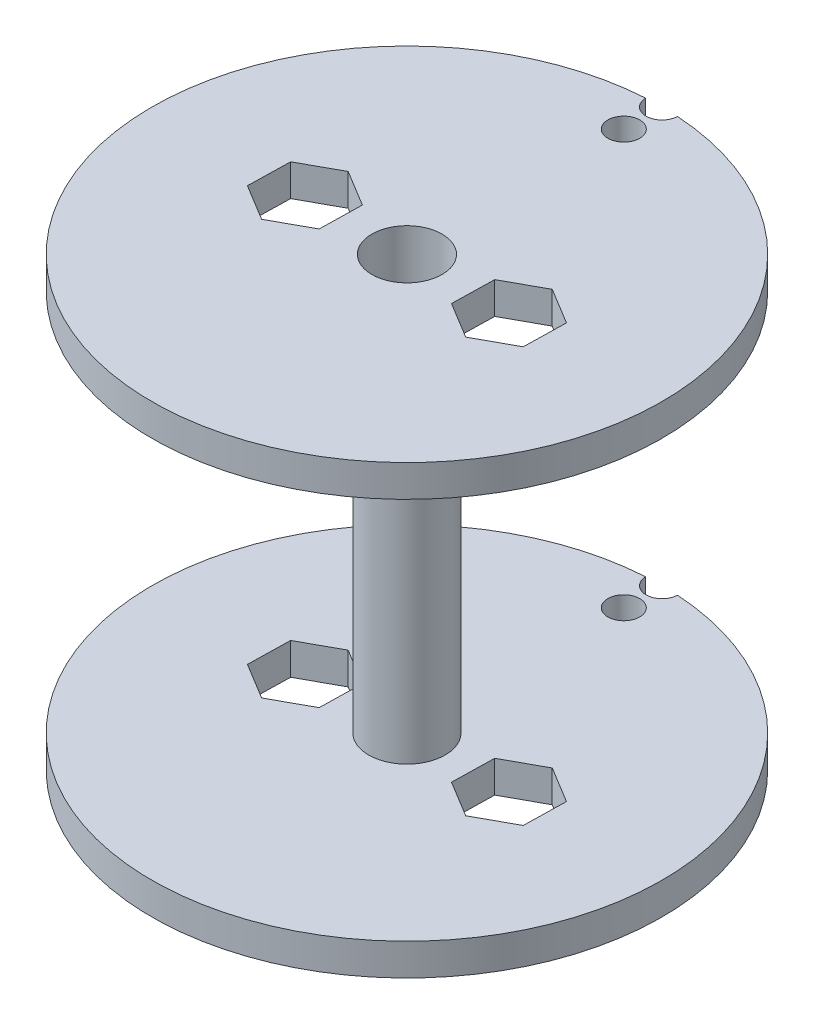
ISO-10303-21;
HEADER;
FILE_DESCRIPTION(('STEP AP214'),'2;1');
FILE_NAME('part.step','',(''),(''),'','','');
FILE_SCHEMA(('AUTOMOTIVE_DESIGN { 1 0 10303 214 1 1 1 1 }'));
ENDSEC;
DATA;
#1=APPLICATION_CONTEXT('core data for automotive mechanical design processes');
#2=APPLICATION_PROTOCOL_DEFINITION('international standard','automotive_design',2000,#1);
#3=PRODUCT_CONTEXT('',#1,'mechanical');
#4=PRODUCT('Part','Part','',(#3));
#5=PRODUCT_RELATED_PRODUCT_CATEGORY('part','',(#4));
#6=PRODUCT_DEFINITION_FORMATION('','',#4);
#7=PRODUCT_DEFINITION_CONTEXT('part definition',#1,'design');
#8=PRODUCT_DEFINITION('design','',#6,#7);
#9=PRODUCT_DEFINITION_SHAPE('','',#8);
#10=(LENGTH_UNIT() NAMED_UNIT(*) SI_UNIT(.MILLI.,.METRE.));
#11=(NAMED_UNIT(*) PLANE_ANGLE_UNIT() SI_UNIT($,.RADIAN.));
#12=(NAMED_UNIT(*) SI_UNIT($,.STERADIAN.) SOLID_ANGLE_UNIT());
#13=UNCERTAINTY_MEASURE_WITH_UNIT(LENGTH_MEASURE(1.E-05),#10,'distance_accuracy_value','');
#14=(GEOMETRIC_REPRESENTATION_CONTEXT(3) GLOBAL_UNCERTAINTY_ASSIGNED_CONTEXT((#13)) GLOBAL_UNIT_ASSIGNED_CONTEXT((#10,
#11,#12)) REPRESENTATION_CONTEXT('',''));
#15=CARTESIAN_POINT('',(0.,0.,0.));
#16=DIRECTION('',(0.,0.,1.));
#17=DIRECTION('',(1.,0.,0.));
#18=AXIS2_PLACEMENT_3D('',#15,#16,#17);
#19=CARTESIAN_POINT('',(0.,2.5,0.));
#20=DIRECTION('',(0.,1.,0.));
#21=DIRECTION('',(0.,0.,1.));
#22=AXIS2_PLACEMENT_3D('',#19,#20,#21);
#23=PLANE('',#22);
#24=DIRECTION('',(-0.0214869779830933,0.,0.999769128237692));
#25=VECTOR('',#24,1.);
#26=CARTESIAN_POINT('',(-5.08999790781407,2.5,-1.59772374233));
#27=LINE('',#26,#25);
#28=CARTESIAN_POINT('',(-5.08999790781407,2.5,-1.59772374233));
#29=VERTEX_POINT('',#28);
#30=CARTESIAN_POINT('',(-5.16132960481908,2.5,1.72127386573417));
#31=VERTEX_POINT('',#30);
#32=EDGE_CURVE('E484',#29,#31,#27,.T.);
#33=ORIENTED_EDGE('',*,*,#32,.T.);
#34=DIRECTION('',(-0.87656895196481,0.,0.48127629533493));
#35=VECTOR('',#34,1.);
#36=CARTESIAN_POINT('',(-5.16132960481908,2.5,1.72127386573417));
#37=LINE('',#36,#35);
#38=CARTESIAN_POINT('',(-8.07133169700495,2.5,3.31899760806487));
#39=VERTEX_POINT('',#38);
#40=EDGE_CURVE('E488',#31,#39,#37,.T.);
#41=ORIENTED_EDGE('',*,*,#40,.T.);
#42=DIRECTION('',(-0.855081973981716,0.,-0.518492832902762));
#43=VECTOR('',#42,1.);
#44=CARTESIAN_POINT('',(-8.07133169700495,2.5,3.31899760806487));
#45=LINE('',#44,#43);
#46=CARTESIAN_POINT('',(-10.9100020921858,2.5,1.59772374233139));
#47=VERTEX_POINT('',#46);
#48=EDGE_CURVE('E493',#39,#47,#45,.T.);
#49=ORIENTED_EDGE('',*,*,#48,.T.);
#50=DIRECTION('',(0.0214869779830943,0.,-0.999769128237692));
#51=VECTOR('',#50,1.);
#52=CARTESIAN_POINT('',(-10.9100020921858,2.5,1.59772374233139));
#53=LINE('',#52,#51);
#54=CARTESIAN_POINT('',(-10.8386703951808,2.5,-1.72127386573279));
#55=VERTEX_POINT('',#54);
#56=EDGE_CURVE('E497',#47,#55,#53,.T.);
#57=ORIENTED_EDGE('',*,*,#56,.T.);
#58=DIRECTION('',(0.87656895196481,0.,-0.48127629533493));
#59=VECTOR('',#58,1.);
#60=CARTESIAN_POINT('',(-10.8386703951808,2.5,-1.72127386573279));
#61=LINE('',#60,#59);
#62=CARTESIAN_POINT('',(-7.92866830299493,2.5,-3.31899760806348));
#63=VERTEX_POINT('',#62);
#64=EDGE_CURVE('E501',#55,#63,#61,.T.);
#65=ORIENTED_EDGE('',*,*,#64,.T.);
#66=DIRECTION('',(0.855081973981716,0.,0.518492832902762));
#67=VECTOR('',#66,1.);
#68=CARTESIAN_POINT('',(-7.92866830299493,2.5,-3.31899760806348));
#69=LINE('',#68,#67);
#70=EDGE_CURVE('E505',#63,#29,#69,.T.);
#71=ORIENTED_EDGE('',*,*,#70,.T.);
#72=EDGE_LOOP('',(#33,#41,#49,#57,#65,#71));
#73=FACE_BOUND('',#72,.T.);
#74=DIRECTION('',(0.0214869779832137,0.,-0.999769128237689));
#75=VECTOR('',#74,1.);
#76=CARTESIAN_POINT('',(5.089997907814,2.5,1.59772374233007));
#77=LINE('',#76,#75);
#78=CARTESIAN_POINT('',(5.089997907814,2.5,1.59772374233007));
#79=VERTEX_POINT('',#78);
#80=CARTESIAN_POINT('',(5.16132960481941,2.5,-1.72127386573409));
#81=VERTEX_POINT('',#80);
#82=EDGE_CURVE('E418',#79,#81,#77,.T.);
#83=ORIENTED_EDGE('',*,*,#82,.T.);
#84=DIRECTION('',(0.876568951964868,0.,-0.481276295334824));
#85=VECTOR('',#84,1.);
#86=CARTESIAN_POINT('',(5.16132960481941,2.5,-1.72127386573409));
#87=LINE('',#86,#85);
#88=CARTESIAN_POINT('',(8.07133169700547,2.5,-3.31899760806444));
#89=VERTEX_POINT('',#88);
#90=EDGE_CURVE('E422',#81,#89,#87,.T.);
#91=ORIENTED_EDGE('',*,*,#90,.T.);
#92=DIRECTION('',(0.855081973981654,0.,0.518492832902865));
#93=VECTOR('',#92,1.);
#94=CARTESIAN_POINT('',(8.07133169700547,2.5,-3.31899760806444));
#95=LINE('',#94,#93);
#96=CARTESIAN_POINT('',(10.9100020921861,2.5,-1.59772374233061));
#97=VERTEX_POINT('',#96);
#98=EDGE_CURVE('E64',#89,#97,#95,.T.);
#99=ORIENTED_EDGE('',*,*,#98,.T.);
#100=DIRECTION('',(-0.021486977983214,0.,0.999769128237689));
#101=VECTOR('',#100,1.);
#102=CARTESIAN_POINT('',(10.9100020921861,2.5,-1.59772374233061));
#103=LINE('',#102,#101);
#104=CARTESIAN_POINT('',(10.8386703951807,2.5,1.72127386573356));
#105=VERTEX_POINT('',#104);
#106=EDGE_CURVE('E429',#97,#105,#103,.T.);
#107=ORIENTED_EDGE('',*,*,#106,.T.);
#108=DIRECTION('',(-0.876568951964868,0.,0.481276295334824));
#109=VECTOR('',#108,1.);
#110=CARTESIAN_POINT('',(10.8386703951807,2.5,1.72127386573356));
#111=LINE('',#110,#109);
#112=CARTESIAN_POINT('',(7.92866830299465,2.5,3.3189976080639));
#113=VERTEX_POINT('',#112);
#114=EDGE_CURVE('E433',#105,#113,#111,.T.);
#115=ORIENTED_EDGE('',*,*,#114,.T.);
#116=DIRECTION('',(-0.855081973981654,0.,-0.518492832902865));
#117=VECTOR('',#116,1.);
#118=CARTESIAN_POINT('',(7.92866830299465,2.5,3.3189976080639));
#119=LINE('',#118,#117);
#120=EDGE_CURVE('E437',#113,#79,#119,.T.);
#121=ORIENTED_EDGE('',*,*,#120,.T.);
#122=EDGE_LOOP('',(#83,#91,#99,#107,#115,#121));
#123=FACE_BOUND('',#122,.T.);
#124=CARTESIAN_POINT('',(0.,2.5,-20.));
#125=DIRECTION('',(0.,1.,0.));
#126=DIRECTION('',(0.,0.,1.));
#127=AXIS2_PLACEMENT_3D('',#124,#125,#126);
#128=CIRCLE('',#127,1.25);
#129=CARTESIAN_POINT('',(-1.24938949935309,2.5,-19.9609375));
#130=VERTEX_POINT('',#129);
#131=CARTESIAN_POINT('',(1.24938949935309,2.5,-19.9609375));
#132=VERTEX_POINT('',#131);
#133=EDGE_CURVE('E409',#130,#132,#128,.T.);
#134=ORIENTED_EDGE('',*,*,#133,.F.);
#135=CARTESIAN_POINT('',(0.,2.5,0.));
#136=DIRECTION('',(0.,1.,0.));
#137=DIRECTION('',(0.,0.,1.));
#138=AXIS2_PLACEMENT_3D('',#135,#136,#137);
#139=CIRCLE('',#138,20.);
#140=EDGE_CURVE('E553',#130,#132,#139,.T.);
#141=ORIENTED_EDGE('',*,*,#140,.T.);
#142=EDGE_LOOP('',(#134,#141));
#143=FACE_BOUND('',#142,.T.);
#144=CARTESIAN_POINT('',(0.,2.5,-17.));
#145=DIRECTION('',(0.,1.,0.));
#146=DIRECTION('',(0.,0.,1.));
#147=AXIS2_PLACEMENT_3D('',#144,#145,#146);
#148=CIRCLE('',#147,1.25);
#149=CARTESIAN_POINT('',(0.,2.5,-15.75));
#150=VERTEX_POINT('',#149);
#151=EDGE_CURVE('E410',#150,#150,#148,.T.);
#152=ORIENTED_EDGE('',*,*,#151,.F.);
#153=EDGE_LOOP('',(#152));
#154=FACE_BOUND('',#153,.T.);
#155=CARTESIAN_POINT('',(0.,2.5,0.));
#156=DIRECTION('',(0.,1.,0.));
#157=DIRECTION('',(0.,0.,1.));
#158=AXIS2_PLACEMENT_3D('',#155,#156,#157);
#159=CIRCLE('',#158,3.);
#160=CARTESIAN_POINT('',(0.,2.5,3.));
#161=VERTEX_POINT('',#160);
#162=EDGE_CURVE('E237',#161,#161,#159,.T.);
#163=ORIENTED_EDGE('',*,*,#162,.F.);
#164=EDGE_LOOP('',(#163));
#165=FACE_BOUND('',#164,.T.);
#166=ADVANCED_FACE('F39',(#73,#123,#143,#154,#165),#23,.T.);
#167=CARTESIAN_POINT('',(0.,0.,0.));
#168=DIRECTION('',(0.,1.,0.));
#169=DIRECTION('',(0.,0.,1.));
#170=AXIS2_PLACEMENT_3D('',#167,#168,#169);
#171=PLANE('',#170);
#172=CARTESIAN_POINT('',(0.,0.,-17.));
#173=DIRECTION('',(0.,1.,0.));
#174=DIRECTION('',(0.,0.,1.));
#175=AXIS2_PLACEMENT_3D('',#172,#173,#174);
#176=CIRCLE('',#175,1.25);
#177=CARTESIAN_POINT('',(0.,0.,-15.75));
#178=VERTEX_POINT('',#177);
#179=EDGE_CURVE('E43',#178,#178,#176,.T.);
#180=ORIENTED_EDGE('',*,*,#179,.T.);
#181=EDGE_LOOP('',(#180));
#182=FACE_BOUND('',#181,.T.);
#183=DIRECTION('',(0.876568951964868,0.,-0.481276295334824));
#184=VECTOR('',#183,1.);
#185=CARTESIAN_POINT('',(5.16132960481941,0.,-1.72127386573409));
#186=LINE('',#185,#184);
#187=CARTESIAN_POINT('',(5.16132960481941,0.,-1.72127386573409));
#188=VERTEX_POINT('',#187);
#189=CARTESIAN_POINT('',(8.07133169700547,0.,-3.31899760806444));
#190=VERTEX_POINT('',#189);
#191=EDGE_CURVE('E445',#188,#190,#186,.T.);
#192=ORIENTED_EDGE('',*,*,#191,.F.);
#193=DIRECTION('',(0.0214869779832137,0.,-0.999769128237689));
#194=VECTOR('',#193,1.);
#195=CARTESIAN_POINT('',(5.089997907814,0.,1.59772374233007));
#196=LINE('',#195,#194);
#197=CARTESIAN_POINT('',(5.089997907814,0.,1.59772374233007));
#198=VERTEX_POINT('',#197);
#199=EDGE_CURVE('E442',#198,#188,#196,.T.);
#200=ORIENTED_EDGE('',*,*,#199,.F.);
#201=DIRECTION('',(-0.855081973981654,0.,-0.518492832902865));
#202=VECTOR('',#201,1.);
#203=CARTESIAN_POINT('',(7.92866830299465,0.,3.3189976080639));
#204=LINE('',#203,#202);
#205=CARTESIAN_POINT('',(7.92866830299465,0.,3.3189976080639));
#206=VERTEX_POINT('',#205);
#207=EDGE_CURVE('E423',#206,#198,#204,.T.);
#208=ORIENTED_EDGE('',*,*,#207,.F.);
#209=DIRECTION('',(-0.876568951964868,0.,0.481276295334824));
#210=VECTOR('',#209,1.);
#211=CARTESIAN_POINT('',(10.8386703951807,0.,1.72127386573356));
#212=LINE('',#211,#210);
#213=CARTESIAN_POINT('',(10.8386703951807,0.,1.72127386573356));
#214=VERTEX_POINT('',#213);
#215=EDGE_CURVE('E458',#214,#206,#212,.T.);
#216=ORIENTED_EDGE('',*,*,#215,.F.);
#217=DIRECTION('',(-0.021486977983214,0.,0.999769128237689));
#218=VECTOR('',#217,1.);
#219=CARTESIAN_POINT('',(10.9100020921861,0.,-1.59772374233061));
#220=LINE('',#219,#218);
#221=CARTESIAN_POINT('',(10.9100020921861,0.,-1.59772374233061));
#222=VERTEX_POINT('',#221);
#223=EDGE_CURVE('E454',#222,#214,#220,.T.);
#224=ORIENTED_EDGE('',*,*,#223,.F.);
#225=DIRECTION('',(0.855081973981654,0.,0.518492832902865));
#226=VECTOR('',#225,1.);
#227=CARTESIAN_POINT('',(8.07133169700547,0.,-3.31899760806444));
#228=LINE('',#227,#226);
#229=EDGE_CURVE('E450',#190,#222,#228,.T.);
#230=ORIENTED_EDGE('',*,*,#229,.F.);
#231=EDGE_LOOP('',(#192,#200,#208,#216,#224,#230));
#232=FACE_BOUND('',#231,.T.);
#233=DIRECTION('',(-0.87656895196481,0.,0.48127629533493));
#234=VECTOR('',#233,1.);
#235=CARTESIAN_POINT('',(-5.16132960481908,0.,1.72127386573417));
#236=LINE('',#235,#234);
#237=CARTESIAN_POINT('',(-5.16132960481908,0.,1.72127386573417));
#238=VERTEX_POINT('',#237);
#239=CARTESIAN_POINT('',(-8.07133169700495,0.,3.31899760806487));
#240=VERTEX_POINT('',#239);
#241=EDGE_CURVE('E513',#238,#240,#236,.T.);
#242=ORIENTED_EDGE('',*,*,#241,.F.);
#243=DIRECTION('',(-0.0214869779830933,0.,0.999769128237692));
#244=VECTOR('',#243,1.);
#245=CARTESIAN_POINT('',(-5.08999790781407,0.,-1.59772374233));
#246=LINE('',#245,#244);
#247=CARTESIAN_POINT('',(-5.08999790781407,0.,-1.59772374233));
#248=VERTEX_POINT('',#247);
#249=EDGE_CURVE('E510',#248,#238,#246,.T.);
#250=ORIENTED_EDGE('',*,*,#249,.F.);
#251=DIRECTION('',(0.855081973981716,0.,0.518492832902762));
#252=VECTOR('',#251,1.);
#253=CARTESIAN_POINT('',(-7.92866830299493,0.,-3.31899760806348));
#254=LINE('',#253,#252);
#255=CARTESIAN_POINT('',(-7.92866830299493,0.,-3.31899760806348));
#256=VERTEX_POINT('',#255);
#257=EDGE_CURVE('E489',#256,#248,#254,.T.);
#258=ORIENTED_EDGE('',*,*,#257,.F.);
#259=DIRECTION('',(0.87656895196481,0.,-0.48127629533493));
#260=VECTOR('',#259,1.);
#261=CARTESIAN_POINT('',(-10.8386703951808,0.,-1.72127386573279));
#262=LINE('',#261,#260);
#263=CARTESIAN_POINT('',(-10.8386703951808,0.,-1.72127386573279));
#264=VERTEX_POINT('',#263);
#265=EDGE_CURVE('E525',#264,#256,#262,.T.);
#266=ORIENTED_EDGE('',*,*,#265,.F.);
#267=DIRECTION('',(0.0214869779830943,0.,-0.999769128237692));
#268=VECTOR('',#267,1.);
#269=CARTESIAN_POINT('',(-10.9100020921858,0.,1.59772374233139));
#270=LINE('',#269,#268);
#271=CARTESIAN_POINT('',(-10.9100020921858,0.,1.59772374233139));
#272=VERTEX_POINT('',#271);
#273=EDGE_CURVE('E521',#272,#264,#270,.T.);
#274=ORIENTED_EDGE('',*,*,#273,.F.);
#275=DIRECTION('',(-0.855081973981716,0.,-0.518492832902762));
#276=VECTOR('',#275,1.);
#277=CARTESIAN_POINT('',(-8.07133169700495,0.,3.31899760806487));
#278=LINE('',#277,#276);
#279=EDGE_CURVE('E517',#240,#272,#278,.T.);
#280=ORIENTED_EDGE('',*,*,#279,.F.);
#281=EDGE_LOOP('',(#242,#250,#258,#266,#274,#280));
#282=FACE_BOUND('',#281,.T.);
#283=CARTESIAN_POINT('',(0.,0.,0.));
#284=DIRECTION('',(0.,1.,0.));
#285=DIRECTION('',(0.,0.,1.));
#286=AXIS2_PLACEMENT_3D('',#283,#284,#285);
#287=CIRCLE('',#286,20.);
#288=CARTESIAN_POINT('',(-1.24938949935309,0.,-19.9609375));
#289=VERTEX_POINT('',#288);
#290=CARTESIAN_POINT('',(1.24938949935308,0.,-19.9609375));
#291=VERTEX_POINT('',#290);
#292=EDGE_CURVE('E552',#289,#291,#287,.T.);
#293=ORIENTED_EDGE('',*,*,#292,.F.);
#294=CARTESIAN_POINT('',(0.,0.,-20.));
#295=DIRECTION('',(0.,1.,0.));
#296=DIRECTION('',(0.,0.,1.));
#297=AXIS2_PLACEMENT_3D('',#294,#295,#296);
#298=CIRCLE('',#297,1.25);
#299=EDGE_CURVE('E56',#289,#291,#298,.T.);
#300=ORIENTED_EDGE('',*,*,#299,.T.);
#301=EDGE_LOOP('',(#293,#300));
#302=FACE_BOUND('',#301,.T.);
#303=CARTESIAN_POINT('',(0.,0.,0.));
#304=DIRECTION('',(0.,1.,0.));
#305=DIRECTION('',(0.,0.,1.));
#306=AXIS2_PLACEMENT_3D('',#303,#304,#305);
#307=CIRCLE('',#306,2.75);
#308=CARTESIAN_POINT('',(0.,0.,2.75));
#309=VERTEX_POINT('',#308);
#310=EDGE_CURVE('E468',#309,#309,#307,.T.);
#311=ORIENTED_EDGE('',*,*,#310,.T.);
#312=EDGE_LOOP('',(#311));
#313=FACE_BOUND('',#312,.T.);
#314=ADVANCED_FACE('F566',(#182,#232,#282,#302,#313),#171,.F.);
#315=CARTESIAN_POINT('',(0.,2.5,0.));
#316=DIRECTION('',(0.,-1.,0.));
#317=DIRECTION('',(0.,0.,-1.));
#318=AXIS2_PLACEMENT_3D('',#315,#316,#317);
#319=CYLINDRICAL_SURFACE('',#318,20.);
#320=ORIENTED_EDGE('',*,*,#292,.T.);
#321=DIRECTION('',(0.,1.,0.));
#322=VECTOR('',#321,1.);
#323=CARTESIAN_POINT('',(1.24938949935309,0.,-19.9609375));
#324=LINE('',#323,#322);
#325=EDGE_CURVE('E11',#291,#132,#324,.T.);
#326=ORIENTED_EDGE('',*,*,#325,.T.);
#327=ORIENTED_EDGE('',*,*,#140,.F.);
#328=DIRECTION('',(0.,1.,0.));
#329=VECTOR('',#328,1.);
#330=CARTESIAN_POINT('',(-1.24938949935309,0.,-19.9609375));
#331=LINE('',#330,#329);
#332=EDGE_CURVE('E49',#130,#289,#331,.F.);
#333=ORIENTED_EDGE('',*,*,#332,.T.);
#334=EDGE_LOOP('',(#320,#326,#327,#333));
#335=FACE_BOUND('',#334,.T.);
#336=ADVANCED_FACE('F41',(#335),#319,.T.);
#337=CARTESIAN_POINT('',(0.,2.5,0.));
#338=DIRECTION('',(0.,-1.,0.));
#339=DIRECTION('',(0.,0.,-1.));
#340=AXIS2_PLACEMENT_3D('',#337,#338,#339);
#341=CYLINDRICAL_SURFACE('',#340,2.75);
#342=ORIENTED_EDGE('',*,*,#310,.F.);
#343=EDGE_LOOP('',(#342));
#344=FACE_BOUND('',#343,.T.);
#345=CARTESIAN_POINT('',(0.,35.,0.));
#346=DIRECTION('',(0.,1.,0.));
#347=DIRECTION('',(0.,0.,1.));
#348=AXIS2_PLACEMENT_3D('',#345,#346,#347);
#349=CIRCLE('',#348,2.75);
#350=CARTESIAN_POINT('',(0.,35.,2.75));
#351=VERTEX_POINT('',#350);
#352=EDGE_CURVE('E316',#351,#351,#349,.T.);
#353=ORIENTED_EDGE('',*,*,#352,.T.);
#354=EDGE_LOOP('',(#353));
#355=FACE_BOUND('',#354,.T.);
#356=ADVANCED_FACE('F572',(#344,#355),#341,.F.);
#357=CARTESIAN_POINT('',(-5.08999790781407,2.5,-1.59772374233));
#358=DIRECTION('',(0.999769128237692,0.,0.0214869779830933));
#359=DIRECTION('',(0.0214869779830933,0.,-0.999769128237692));
#360=AXIS2_PLACEMENT_3D('',#357,#358,#359);
#361=PLANE('',#360);
#362=ORIENTED_EDGE('',*,*,#249,.T.);
#363=DIRECTION('',(0.,-1.,0.));
#364=VECTOR('',#363,1.);
#365=CARTESIAN_POINT('',(-5.16132960481908,2.5,1.72127386573417));
#366=LINE('',#365,#364);
#367=EDGE_CURVE('E509',#31,#238,#366,.T.);
#368=ORIENTED_EDGE('',*,*,#367,.F.);
#369=ORIENTED_EDGE('',*,*,#32,.F.);
#370=DIRECTION('',(0.,-1.,0.));
#371=VECTOR('',#370,1.);
#372=CARTESIAN_POINT('',(-5.08999790781407,2.5,-1.59772374233));
#373=LINE('',#372,#371);
#374=EDGE_CURVE('E446',#29,#248,#373,.T.);
#375=ORIENTED_EDGE('',*,*,#374,.T.);
#376=EDGE_LOOP('',(#362,#368,#369,#375));
#377=FACE_BOUND('',#376,.T.);
#378=ADVANCED_FACE('F575',(#377),#361,.F.);
#379=CARTESIAN_POINT('',(-7.92866830299493,2.5,-3.31899760806348));
#380=DIRECTION('',(0.518492832902762,0.,-0.855081973981716));
#381=DIRECTION('',(-0.855081973981716,0.,-0.518492832902762));
#382=AXIS2_PLACEMENT_3D('',#379,#380,#381);
#383=PLANE('',#382);
#384=ORIENTED_EDGE('',*,*,#257,.T.);
#385=ORIENTED_EDGE('',*,*,#374,.F.);
#386=ORIENTED_EDGE('',*,*,#70,.F.);
#387=DIRECTION('',(0.,-1.,0.));
#388=VECTOR('',#387,1.);
#389=CARTESIAN_POINT('',(-7.92866830299493,2.5,-3.31899760806348));
#390=LINE('',#389,#388);
#391=EDGE_CURVE('E534',#63,#256,#390,.T.);
#392=ORIENTED_EDGE('',*,*,#391,.T.);
#393=EDGE_LOOP('',(#384,#385,#386,#392));
#394=FACE_BOUND('',#393,.T.);
#395=ADVANCED_FACE('F603',(#394),#383,.F.);
#396=CARTESIAN_POINT('',(-10.8386703951808,2.5,-1.72127386573279));
#397=DIRECTION('',(-0.48127629533493,0.,-0.87656895196481));
#398=DIRECTION('',(-0.87656895196481,0.,0.48127629533493));
#399=AXIS2_PLACEMENT_3D('',#396,#397,#398);
#400=PLANE('',#399);
#401=ORIENTED_EDGE('',*,*,#265,.T.);
#402=ORIENTED_EDGE('',*,*,#391,.F.);
#403=ORIENTED_EDGE('',*,*,#64,.F.);
#404=DIRECTION('',(0.,-1.,0.));
#405=VECTOR('',#404,1.);
#406=CARTESIAN_POINT('',(-10.8386703951808,2.5,-1.72127386573279));
#407=LINE('',#406,#405);
#408=EDGE_CURVE('E537',#55,#264,#407,.T.);
#409=ORIENTED_EDGE('',*,*,#408,.T.);
#410=EDGE_LOOP('',(#401,#402,#403,#409));
#411=FACE_BOUND('',#410,.T.);
#412=ADVANCED_FACE('F617',(#411),#400,.F.);
#413=CARTESIAN_POINT('',(-10.9100020921858,2.5,1.59772374233139));
#414=DIRECTION('',(-0.999769128237692,0.,-0.0214869779830943));
#415=DIRECTION('',(-0.0214869779830943,0.,0.999769128237692));
#416=AXIS2_PLACEMENT_3D('',#413,#414,#415);
#417=PLANE('',#416);
#418=ORIENTED_EDGE('',*,*,#273,.T.);
#419=ORIENTED_EDGE('',*,*,#408,.F.);
#420=ORIENTED_EDGE('',*,*,#56,.F.);
#421=DIRECTION('',(0.,-1.,0.));
#422=VECTOR('',#421,1.);
#423=CARTESIAN_POINT('',(-10.9100020921858,2.5,1.59772374233139));
#424=LINE('',#423,#422);
#425=EDGE_CURVE('E540',#47,#272,#424,.T.);
#426=ORIENTED_EDGE('',*,*,#425,.T.);
#427=EDGE_LOOP('',(#418,#419,#420,#426));
#428=FACE_BOUND('',#427,.T.);
#429=ADVANCED_FACE('F613',(#428),#417,.F.);
#430=CARTESIAN_POINT('',(-8.07133169700495,2.5,3.31899760806487));
#431=DIRECTION('',(-0.518492832902762,0.,0.855081973981716));
#432=DIRECTION('',(0.855081973981716,0.,0.518492832902762));
#433=AXIS2_PLACEMENT_3D('',#430,#431,#432);
#434=PLANE('',#433);
#435=ORIENTED_EDGE('',*,*,#279,.T.);
#436=ORIENTED_EDGE('',*,*,#425,.F.);
#437=ORIENTED_EDGE('',*,*,#48,.F.);
#438=DIRECTION('',(0.,-1.,0.));
#439=VECTOR('',#438,1.);
#440=CARTESIAN_POINT('',(-8.07133169700495,2.5,3.31899760806487));
#441=LINE('',#440,#439);
#442=EDGE_CURVE('E543',#39,#240,#441,.T.);
#443=ORIENTED_EDGE('',*,*,#442,.T.);
#444=EDGE_LOOP('',(#435,#436,#437,#443));
#445=FACE_BOUND('',#444,.T.);
#446=ADVANCED_FACE('F609',(#445),#434,.F.);
#447=CARTESIAN_POINT('',(-5.16132960481908,2.5,1.72127386573417));
#448=DIRECTION('',(0.48127629533493,0.,0.87656895196481));
#449=DIRECTION('',(0.87656895196481,0.,-0.48127629533493));
#450=AXIS2_PLACEMENT_3D('',#447,#448,#449);
#451=PLANE('',#450);
#452=ORIENTED_EDGE('',*,*,#241,.T.);
#453=ORIENTED_EDGE('',*,*,#442,.F.);
#454=ORIENTED_EDGE('',*,*,#40,.F.);
#455=ORIENTED_EDGE('',*,*,#367,.T.);
#456=EDGE_LOOP('',(#452,#453,#454,#455));
#457=FACE_BOUND('',#456,.T.);
#458=ADVANCED_FACE('F605',(#457),#451,.F.);
#459=CARTESIAN_POINT('',(5.089997907814,2.5,1.59772374233007));
#460=DIRECTION('',(-0.999769128237689,0.,-0.0214869779832137));
#461=DIRECTION('',(-0.0214869779832137,0.,0.999769128237689));
#462=AXIS2_PLACEMENT_3D('',#459,#460,#461);
#463=PLANE('',#462);
#464=ORIENTED_EDGE('',*,*,#199,.T.);
#465=DIRECTION('',(0.,-1.,0.));
#466=VECTOR('',#465,1.);
#467=CARTESIAN_POINT('',(5.16132960481941,2.5,-1.72127386573409));
#468=LINE('',#467,#466);
#469=EDGE_CURVE('E441',#81,#188,#468,.T.);
#470=ORIENTED_EDGE('',*,*,#469,.F.);
#471=ORIENTED_EDGE('',*,*,#82,.F.);
#472=DIRECTION('',(0.,-1.,0.));
#473=VECTOR('',#472,1.);
#474=CARTESIAN_POINT('',(5.089997907814,2.5,1.59772374233007));
#475=LINE('',#474,#473);
#476=EDGE_CURVE('E465',#79,#198,#475,.T.);
#477=ORIENTED_EDGE('',*,*,#476,.T.);
#478=EDGE_LOOP('',(#464,#470,#471,#477));
#479=FACE_BOUND('',#478,.T.);
#480=ADVANCED_FACE('F608',(#479),#463,.F.);
#481=CARTESIAN_POINT('',(7.92866830299465,2.5,3.3189976080639));
#482=DIRECTION('',(-0.518492832902865,0.,0.855081973981654));
#483=DIRECTION('',(0.855081973981654,0.,0.518492832902865));
#484=AXIS2_PLACEMENT_3D('',#481,#482,#483);
#485=PLANE('',#484);
#486=ORIENTED_EDGE('',*,*,#207,.T.);
#487=ORIENTED_EDGE('',*,*,#476,.F.);
#488=ORIENTED_EDGE('',*,*,#120,.F.);
#489=DIRECTION('',(0.,-1.,0.));
#490=VECTOR('',#489,1.);
#491=CARTESIAN_POINT('',(7.92866830299465,2.5,3.3189976080639));
#492=LINE('',#491,#490);
#493=EDGE_CURVE('E469',#113,#206,#492,.T.);
#494=ORIENTED_EDGE('',*,*,#493,.T.);
#495=EDGE_LOOP('',(#486,#487,#488,#494));
#496=FACE_BOUND('',#495,.T.);
#497=ADVANCED_FACE('F627',(#496),#485,.F.);
#498=CARTESIAN_POINT('',(10.8386703951807,2.5,1.72127386573356));
#499=DIRECTION('',(0.481276295334824,0.,0.876568951964868));
#500=DIRECTION('',(0.876568951964868,0.,-0.481276295334824));
#501=AXIS2_PLACEMENT_3D('',#498,#499,#500);
#502=PLANE('',#501);
#503=ORIENTED_EDGE('',*,*,#215,.T.);
#504=ORIENTED_EDGE('',*,*,#493,.F.);
#505=ORIENTED_EDGE('',*,*,#114,.F.);
#506=DIRECTION('',(0.,-1.,0.));
#507=VECTOR('',#506,1.);
#508=CARTESIAN_POINT('',(10.8386703951807,2.5,1.72127386573356));
#509=LINE('',#508,#507);
#510=EDGE_CURVE('E472',#105,#214,#509,.T.);
#511=ORIENTED_EDGE('',*,*,#510,.T.);
#512=EDGE_LOOP('',(#503,#504,#505,#511));
#513=FACE_BOUND('',#512,.T.);
#514=ADVANCED_FACE('F640',(#513),#502,.F.);
#515=CARTESIAN_POINT('',(10.9100020921861,2.5,-1.59772374233061));
#516=DIRECTION('',(0.999769128237689,0.,0.021486977983214));
#517=DIRECTION('',(0.021486977983214,0.,-0.999769128237689));
#518=AXIS2_PLACEMENT_3D('',#515,#516,#517);
#519=PLANE('',#518);
#520=ORIENTED_EDGE('',*,*,#223,.T.);
#521=ORIENTED_EDGE('',*,*,#510,.F.);
#522=ORIENTED_EDGE('',*,*,#106,.F.);
#523=DIRECTION('',(0.,-1.,0.));
#524=VECTOR('',#523,1.);
#525=CARTESIAN_POINT('',(10.9100020921861,2.5,-1.59772374233061));
#526=LINE('',#525,#524);
#527=EDGE_CURVE('E475',#97,#222,#526,.T.);
#528=ORIENTED_EDGE('',*,*,#527,.T.);
#529=EDGE_LOOP('',(#520,#521,#522,#528));
#530=FACE_BOUND('',#529,.T.);
#531=ADVANCED_FACE('F637',(#530),#519,.F.);
#532=CARTESIAN_POINT('',(8.07133169700547,2.5,-3.31899760806444));
#533=DIRECTION('',(0.518492832902865,0.,-0.855081973981654));
#534=DIRECTION('',(-0.855081973981654,0.,-0.518492832902865));
#535=AXIS2_PLACEMENT_3D('',#532,#533,#534);
#536=PLANE('',#535);
#537=ORIENTED_EDGE('',*,*,#229,.T.);
#538=ORIENTED_EDGE('',*,*,#527,.F.);
#539=ORIENTED_EDGE('',*,*,#98,.F.);
#540=DIRECTION('',(0.,-1.,0.));
#541=VECTOR('',#540,1.);
#542=CARTESIAN_POINT('',(8.07133169700547,2.5,-3.31899760806444));
#543=LINE('',#542,#541);
#544=EDGE_CURVE('E478',#89,#190,#543,.T.);
#545=ORIENTED_EDGE('',*,*,#544,.T.);
#546=EDGE_LOOP('',(#537,#538,#539,#545));
#547=FACE_BOUND('',#546,.T.);
#548=ADVANCED_FACE('F633',(#547),#536,.F.);
#549=CARTESIAN_POINT('',(5.16132960481941,2.5,-1.72127386573409));
#550=DIRECTION('',(-0.481276295334824,0.,-0.876568951964868));
#551=DIRECTION('',(-0.876568951964868,0.,0.481276295334825));
#552=AXIS2_PLACEMENT_3D('',#549,#550,#551);
#553=PLANE('',#552);
#554=ORIENTED_EDGE('',*,*,#191,.T.);
#555=ORIENTED_EDGE('',*,*,#544,.F.);
#556=ORIENTED_EDGE('',*,*,#90,.F.);
#557=ORIENTED_EDGE('',*,*,#469,.T.);
#558=EDGE_LOOP('',(#554,#555,#556,#557));
#559=FACE_BOUND('',#558,.T.);
#560=ADVANCED_FACE('F629',(#559),#553,.F.);
#561=CARTESIAN_POINT('',(0.,-2.5,-20.));
#562=DIRECTION('',(0.,1.,0.));
#563=DIRECTION('',(0.,0.,1.));
#564=AXIS2_PLACEMENT_3D('',#561,#562,#563);
#565=CYLINDRICAL_SURFACE('',#564,1.25);
#566=ORIENTED_EDGE('',*,*,#299,.F.);
#567=ORIENTED_EDGE('',*,*,#332,.F.);
#568=ORIENTED_EDGE('',*,*,#133,.T.);
#569=ORIENTED_EDGE('',*,*,#325,.F.);
#570=EDGE_LOOP('',(#566,#567,#568,#569));
#571=FACE_BOUND('',#570,.T.);
#572=ADVANCED_FACE('F632',(#571),#565,.F.);
#573=CARTESIAN_POINT('',(0.,-2.5,-17.));
#574=DIRECTION('',(0.,1.,0.));
#575=DIRECTION('',(0.,0.,1.));
#576=AXIS2_PLACEMENT_3D('',#573,#574,#575);
#577=CYLINDRICAL_SURFACE('',#576,1.25);
#578=ORIENTED_EDGE('',*,*,#151,.T.);
#579=EDGE_LOOP('',(#578));
#580=FACE_BOUND('',#579,.T.);
#581=ORIENTED_EDGE('',*,*,#179,.F.);
#582=EDGE_LOOP('',(#581));
#583=FACE_BOUND('',#582,.T.);
#584=ADVANCED_FACE('F650',(#580,#583),#577,.F.);
#585=CARTESIAN_POINT('',(0.,17.5,0.));
#586=DIRECTION('',(0.,-1.,0.));
#587=DIRECTION('',(0.,0.,-1.));
#588=AXIS2_PLACEMENT_3D('',#585,#586,#587);
#589=CYLINDRICAL_SURFACE('',#588,3.);
#590=ORIENTED_EDGE('',*,*,#162,.T.);
#591=EDGE_LOOP('',(#590));
#592=FACE_BOUND('',#591,.T.);
#593=CARTESIAN_POINT('',(0.,32.5,0.));
#594=DIRECTION('',(0.,1.,0.));
#595=DIRECTION('',(0.,0.,1.));
#596=AXIS2_PLACEMENT_3D('',#593,#594,#595);
#597=CIRCLE('',#596,3.);
#598=CARTESIAN_POINT('',(0.,32.5,3.));
#599=VERTEX_POINT('',#598);
#600=EDGE_CURVE('E251',#599,#599,#597,.T.);
#601=ORIENTED_EDGE('',*,*,#600,.F.);
#602=EDGE_LOOP('',(#601));
#603=FACE_BOUND('',#602,.T.);
#604=ADVANCED_FACE('F589',(#592,#603),#589,.T.);
#605=CARTESIAN_POINT('',(0.,32.5,0.));
#606=DIRECTION('',(0.,-1.,0.));
#607=DIRECTION('',(0.,0.,1.));
#608=AXIS2_PLACEMENT_3D('',#605,#606,#607);
#609=PLANE('',#608);
#610=DIRECTION('',(-0.0214869779830933,0.,0.999769128237692));
#611=VECTOR('',#610,1.);
#612=CARTESIAN_POINT('',(-5.08999790781407,32.5,-1.59772374233));
#613=LINE('',#612,#611);
#614=CARTESIAN_POINT('',(-5.08999790781407,32.5,-1.59772374233));
#615=VERTEX_POINT('',#614);
#616=CARTESIAN_POINT('',(-5.16132960481908,32.5,1.72127386573417));
#617=VERTEX_POINT('',#616);
#618=EDGE_CURVE('E331',#615,#617,#613,.T.);
#619=ORIENTED_EDGE('',*,*,#618,.F.);
#620=DIRECTION('',(0.855081973981716,0.,0.518492832902762));
#621=VECTOR('',#620,1.);
#622=CARTESIAN_POINT('',(-7.92866830299493,32.5,-3.31899760806348));
#623=LINE('',#622,#621);
#624=CARTESIAN_POINT('',(-7.92866830299493,32.5,-3.31899760806348));
#625=VERTEX_POINT('',#624);
#626=EDGE_CURVE('E352',#625,#615,#623,.T.);
#627=ORIENTED_EDGE('',*,*,#626,.F.);
#628=DIRECTION('',(0.87656895196481,0.,-0.48127629533493));
#629=VECTOR('',#628,1.);
#630=CARTESIAN_POINT('',(-10.8386703951808,32.5,-1.72127386573279));
#631=LINE('',#630,#629);
#632=CARTESIAN_POINT('',(-10.8386703951808,32.5,-1.72127386573279));
#633=VERTEX_POINT('',#632);
#634=EDGE_CURVE('E348',#633,#625,#631,.T.);
#635=ORIENTED_EDGE('',*,*,#634,.F.);
#636=DIRECTION('',(0.0214869779830943,0.,-0.999769128237692));
#637=VECTOR('',#636,1.);
#638=CARTESIAN_POINT('',(-10.9100020921858,32.5,1.59772374233139));
#639=LINE('',#638,#637);
#640=CARTESIAN_POINT('',(-10.9100020921858,32.5,1.59772374233139));
#641=VERTEX_POINT('',#640);
#642=EDGE_CURVE('E344',#641,#633,#639,.T.);
#643=ORIENTED_EDGE('',*,*,#642,.F.);
#644=DIRECTION('',(-0.855081973981716,0.,-0.518492832902762));
#645=VECTOR('',#644,1.);
#646=CARTESIAN_POINT('',(-8.07133169700495,32.5,3.31899760806487));
#647=LINE('',#646,#645);
#648=CARTESIAN_POINT('',(-8.07133169700495,32.5,3.31899760806487));
#649=VERTEX_POINT('',#648);
#650=EDGE_CURVE('E340',#649,#641,#647,.T.);
#651=ORIENTED_EDGE('',*,*,#650,.F.);
#652=DIRECTION('',(-0.87656895196481,0.,0.48127629533493));
#653=VECTOR('',#652,1.);
#654=CARTESIAN_POINT('',(-5.16132960481908,32.5,1.72127386573417));
#655=LINE('',#654,#653);
#656=EDGE_CURVE('E335',#617,#649,#655,.T.);
#657=ORIENTED_EDGE('',*,*,#656,.F.);
#658=EDGE_LOOP('',(#619,#627,#635,#643,#651,#657));
#659=FACE_BOUND('',#658,.T.);
#660=DIRECTION('',(0.0214869779832137,0.,-0.999769128237689));
#661=VECTOR('',#660,1.);
#662=CARTESIAN_POINT('',(5.089997907814,32.5,1.59772374233007));
#663=LINE('',#662,#661);
#664=CARTESIAN_POINT('',(5.089997907814,32.5,1.59772374233007));
#665=VERTEX_POINT('',#664);
#666=CARTESIAN_POINT('',(5.16132960481941,32.5,-1.72127386573409));
#667=VERTEX_POINT('',#666);
#668=EDGE_CURVE('E263',#665,#667,#663,.T.);
#669=ORIENTED_EDGE('',*,*,#668,.F.);
#670=DIRECTION('',(-0.855081973981654,0.,-0.518492832902865));
#671=VECTOR('',#670,1.);
#672=CARTESIAN_POINT('',(7.92866830299465,32.5,3.3189976080639));
#673=LINE('',#672,#671);
#674=CARTESIAN_POINT('',(7.92866830299465,32.5,3.3189976080639));
#675=VERTEX_POINT('',#674);
#676=EDGE_CURVE('E284',#675,#665,#673,.T.);
#677=ORIENTED_EDGE('',*,*,#676,.F.);
#678=DIRECTION('',(-0.876568951964868,0.,0.481276295334824));
#679=VECTOR('',#678,1.);
#680=CARTESIAN_POINT('',(10.8386703951807,32.5,1.72127386573356));
#681=LINE('',#680,#679);
#682=CARTESIAN_POINT('',(10.8386703951807,32.5,1.72127386573356));
#683=VERTEX_POINT('',#682);
#684=EDGE_CURVE('E280',#683,#675,#681,.T.);
#685=ORIENTED_EDGE('',*,*,#684,.F.);
#686=DIRECTION('',(-0.021486977983214,0.,0.999769128237689));
#687=VECTOR('',#686,1.);
#688=CARTESIAN_POINT('',(10.9100020921861,32.5,-1.59772374233061));
#689=LINE('',#688,#687);
#690=CARTESIAN_POINT('',(10.9100020921861,32.5,-1.59772374233061));
#691=VERTEX_POINT('',#690);
#692=EDGE_CURVE('E276',#691,#683,#689,.T.);
#693=ORIENTED_EDGE('',*,*,#692,.F.);
#694=DIRECTION('',(0.855081973981654,0.,0.518492832902865));
#695=VECTOR('',#694,1.);
#696=CARTESIAN_POINT('',(8.07133169700547,32.5,-3.31899760806444));
#697=LINE('',#696,#695);
#698=CARTESIAN_POINT('',(8.07133169700547,32.5,-3.31899760806444));
#699=VERTEX_POINT('',#698);
#700=EDGE_CURVE('E272',#699,#691,#697,.T.);
#701=ORIENTED_EDGE('',*,*,#700,.F.);
#702=DIRECTION('',(0.876568951964868,0.,-0.481276295334824));
#703=VECTOR('',#702,1.);
#704=CARTESIAN_POINT('',(5.16132960481941,32.5,-1.72127386573409));
#705=LINE('',#704,#703);
#706=EDGE_CURVE('E267',#667,#699,#705,.T.);
#707=ORIENTED_EDGE('',*,*,#706,.F.);
#708=EDGE_LOOP('',(#669,#677,#685,#693,#701,#707));
#709=FACE_BOUND('',#708,.T.);
#710=CARTESIAN_POINT('',(0.,32.5,-20.));
#711=DIRECTION('',(0.,1.,0.));
#712=DIRECTION('',(0.,0.,1.));
#713=AXIS2_PLACEMENT_3D('',#710,#711,#712);
#714=CIRCLE('',#713,1.25);
#715=CARTESIAN_POINT('',(-1.24938949935309,32.5,-19.9609375));
#716=VERTEX_POINT('',#715);
#717=CARTESIAN_POINT('',(1.24938949935309,32.5,-19.9609375));
#718=VERTEX_POINT('',#717);
#719=EDGE_CURVE('E230',#716,#718,#714,.T.);
#720=ORIENTED_EDGE('',*,*,#719,.T.);
#721=CARTESIAN_POINT('',(0.,32.5,0.));
#722=DIRECTION('',(0.,1.,0.));
#723=DIRECTION('',(0.,0.,1.));
#724=AXIS2_PLACEMENT_3D('',#721,#722,#723);
#725=CIRCLE('',#724,20.);
#726=EDGE_CURVE('E241',#716,#718,#725,.T.);
#727=ORIENTED_EDGE('',*,*,#726,.F.);
#728=EDGE_LOOP('',(#720,#727));
#729=FACE_BOUND('',#728,.T.);
#730=CARTESIAN_POINT('',(0.,32.5,-17.));
#731=DIRECTION('',(0.,1.,0.));
#732=DIRECTION('',(0.,0.,1.));
#733=AXIS2_PLACEMENT_3D('',#730,#731,#732);
#734=CIRCLE('',#733,1.25);
#735=CARTESIAN_POINT('',(0.,32.5,-15.75));
#736=VERTEX_POINT('',#735);
#737=EDGE_CURVE('E250',#736,#736,#734,.T.);
#738=ORIENTED_EDGE('',*,*,#737,.T.);
#739=EDGE_LOOP('',(#738));
#740=FACE_BOUND('',#739,.T.);
#741=ORIENTED_EDGE('',*,*,#600,.T.);
#742=EDGE_LOOP('',(#741));
#743=FACE_BOUND('',#742,.T.);
#744=ADVANCED_FACE('F247',(#659,#709,#729,#740,#743),#609,.T.);
#745=CARTESIAN_POINT('',(0.,35.,0.));
#746=DIRECTION('',(0.,-1.,0.));
#747=DIRECTION('',(0.,0.,1.));
#748=AXIS2_PLACEMENT_3D('',#745,#746,#747);
#749=PLANE('',#748);
#750=CARTESIAN_POINT('',(0.,35.,-17.));
#751=DIRECTION('',(0.,1.,0.));
#752=DIRECTION('',(0.,0.,1.));
#753=AXIS2_PLACEMENT_3D('',#750,#751,#752);
#754=CIRCLE('',#753,1.25);
#755=CARTESIAN_POINT('',(0.,35.,-15.75));
#756=VERTEX_POINT('',#755);
#757=EDGE_CURVE('E262',#756,#756,#754,.T.);
#758=ORIENTED_EDGE('',*,*,#757,.F.);
#759=EDGE_LOOP('',(#758));
#760=FACE_BOUND('',#759,.T.);
#761=DIRECTION('',(0.876568951964868,0.,-0.481276295334824));
#762=VECTOR('',#761,1.);
#763=CARTESIAN_POINT('',(5.16132960481941,35.,-1.72127386573409));
#764=LINE('',#763,#762);
#765=CARTESIAN_POINT('',(5.16132960481941,35.,-1.72127386573409));
#766=VERTEX_POINT('',#765);
#767=CARTESIAN_POINT('',(8.07133169700547,35.,-3.31899760806444));
#768=VERTEX_POINT('',#767);
#769=EDGE_CURVE('E293',#766,#768,#764,.T.);
#770=ORIENTED_EDGE('',*,*,#769,.T.);
#771=DIRECTION('',(0.855081973981654,0.,0.518492832902865));
#772=VECTOR('',#771,1.);
#773=CARTESIAN_POINT('',(8.07133169700547,35.,-3.31899760806444));
#774=LINE('',#773,#772);
#775=CARTESIAN_POINT('',(10.9100020921861,35.,-1.59772374233061));
#776=VERTEX_POINT('',#775);
#777=EDGE_CURVE('E298',#768,#776,#774,.T.);
#778=ORIENTED_EDGE('',*,*,#777,.T.);
#779=DIRECTION('',(-0.021486977983214,0.,0.999769128237689));
#780=VECTOR('',#779,1.);
#781=CARTESIAN_POINT('',(10.9100020921861,35.,-1.59772374233061));
#782=LINE('',#781,#780);
#783=CARTESIAN_POINT('',(10.8386703951807,35.,1.72127386573356));
#784=VERTEX_POINT('',#783);
#785=EDGE_CURVE('E302',#776,#784,#782,.T.);
#786=ORIENTED_EDGE('',*,*,#785,.T.);
#787=DIRECTION('',(-0.876568951964868,0.,0.481276295334824));
#788=VECTOR('',#787,1.);
#789=CARTESIAN_POINT('',(10.8386703951807,35.,1.72127386573356));
#790=LINE('',#789,#788);
#791=CARTESIAN_POINT('',(7.92866830299465,35.,3.3189976080639));
#792=VERTEX_POINT('',#791);
#793=EDGE_CURVE('E306',#784,#792,#790,.T.);
#794=ORIENTED_EDGE('',*,*,#793,.T.);
#795=DIRECTION('',(-0.855081973981654,0.,-0.518492832902865));
#796=VECTOR('',#795,1.);
#797=CARTESIAN_POINT('',(7.92866830299465,35.,3.3189976080639));
#798=LINE('',#797,#796);
#799=CARTESIAN_POINT('',(5.089997907814,35.,1.59772374233007));
#800=VERTEX_POINT('',#799);
#801=EDGE_CURVE('E268',#792,#800,#798,.T.);
#802=ORIENTED_EDGE('',*,*,#801,.T.);
#803=DIRECTION('',(0.0214869779832137,0.,-0.999769128237689));
#804=VECTOR('',#803,1.);
#805=CARTESIAN_POINT('',(5.089997907814,35.,1.59772374233007));
#806=LINE('',#805,#804);
#807=EDGE_CURVE('E289',#800,#766,#806,.T.);
#808=ORIENTED_EDGE('',*,*,#807,.T.);
#809=EDGE_LOOP('',(#770,#778,#786,#794,#802,#808));
#810=FACE_BOUND('',#809,.T.);
#811=DIRECTION('',(-0.87656895196481,0.,0.48127629533493));
#812=VECTOR('',#811,1.);
#813=CARTESIAN_POINT('',(-5.16132960481908,35.,1.72127386573417));
#814=LINE('',#813,#812);
#815=CARTESIAN_POINT('',(-5.16132960481908,35.,1.72127386573417));
#816=VERTEX_POINT('',#815);
#817=CARTESIAN_POINT('',(-8.07133169700495,35.,3.31899760806487));
#818=VERTEX_POINT('',#817);
#819=EDGE_CURVE('E361',#816,#818,#814,.T.);
#820=ORIENTED_EDGE('',*,*,#819,.T.);
#821=DIRECTION('',(-0.855081973981716,0.,-0.518492832902762));
#822=VECTOR('',#821,1.);
#823=CARTESIAN_POINT('',(-8.07133169700495,35.,3.31899760806487));
#824=LINE('',#823,#822);
#825=CARTESIAN_POINT('',(-10.9100020921858,35.,1.59772374233139));
#826=VERTEX_POINT('',#825);
#827=EDGE_CURVE('E365',#818,#826,#824,.T.);
#828=ORIENTED_EDGE('',*,*,#827,.T.);
#829=DIRECTION('',(0.0214869779830943,0.,-0.999769128237692));
#830=VECTOR('',#829,1.);
#831=CARTESIAN_POINT('',(-10.9100020921858,35.,1.59772374233139));
#832=LINE('',#831,#830);
#833=CARTESIAN_POINT('',(-10.8386703951808,35.,-1.72127386573279));
#834=VERTEX_POINT('',#833);
#835=EDGE_CURVE('E369',#826,#834,#832,.T.);
#836=ORIENTED_EDGE('',*,*,#835,.T.);
#837=DIRECTION('',(0.87656895196481,0.,-0.48127629533493));
#838=VECTOR('',#837,1.);
#839=CARTESIAN_POINT('',(-10.8386703951808,35.,-1.72127386573279));
#840=LINE('',#839,#838);
#841=CARTESIAN_POINT('',(-7.92866830299493,35.,-3.31899760806348));
#842=VERTEX_POINT('',#841);
#843=EDGE_CURVE('E373',#834,#842,#840,.T.);
#844=ORIENTED_EDGE('',*,*,#843,.T.);
#845=DIRECTION('',(0.855081973981716,0.,0.518492832902762));
#846=VECTOR('',#845,1.);
#847=CARTESIAN_POINT('',(-7.92866830299493,35.,-3.31899760806348));
#848=LINE('',#847,#846);
#849=CARTESIAN_POINT('',(-5.08999790781407,35.,-1.59772374233));
#850=VERTEX_POINT('',#849);
#851=EDGE_CURVE('E336',#842,#850,#848,.T.);
#852=ORIENTED_EDGE('',*,*,#851,.T.);
#853=DIRECTION('',(-0.0214869779830933,0.,0.999769128237692));
#854=VECTOR('',#853,1.);
#855=CARTESIAN_POINT('',(-5.08999790781407,35.,-1.59772374233));
#856=LINE('',#855,#854);
#857=EDGE_CURVE('E357',#850,#816,#856,.T.);
#858=ORIENTED_EDGE('',*,*,#857,.T.);
#859=EDGE_LOOP('',(#820,#828,#836,#844,#852,#858));
#860=FACE_BOUND('',#859,.T.);
#861=CARTESIAN_POINT('',(0.,35.,0.));
#862=DIRECTION('',(0.,1.,0.));
#863=DIRECTION('',(0.,0.,1.));
#864=AXIS2_PLACEMENT_3D('',#861,#862,#863);
#865=CIRCLE('',#864,20.);
#866=CARTESIAN_POINT('',(-1.24938949935309,35.,-19.9609375));
#867=VERTEX_POINT('',#866);
#868=CARTESIAN_POINT('',(1.24938949935308,35.,-19.9609375));
#869=VERTEX_POINT('',#868);
#870=EDGE_CURVE('E245',#867,#869,#865,.T.);
#871=ORIENTED_EDGE('',*,*,#870,.T.);
#872=CARTESIAN_POINT('',(0.,35.,-20.));
#873=DIRECTION('',(0.,1.,0.));
#874=DIRECTION('',(0.,0.,1.));
#875=AXIS2_PLACEMENT_3D('',#872,#873,#874);
#876=CIRCLE('',#875,1.25);
#877=EDGE_CURVE('E232',#867,#869,#876,.T.);
#878=ORIENTED_EDGE('',*,*,#877,.F.);
#879=EDGE_LOOP('',(#871,#878));
#880=FACE_BOUND('',#879,.T.);
#881=ORIENTED_EDGE('',*,*,#352,.F.);
#882=EDGE_LOOP('',(#881));
#883=FACE_BOUND('',#882,.T.);
#884=ADVANCED_FACE('F579',(#760,#810,#860,#880,#883),#749,.F.);
#885=CARTESIAN_POINT('',(0.,32.5,0.));
#886=DIRECTION('',(0.,1.,0.));
#887=DIRECTION('',(0.,0.,-1.));
#888=AXIS2_PLACEMENT_3D('',#885,#886,#887);
#889=CYLINDRICAL_SURFACE('',#888,20.);
#890=ORIENTED_EDGE('',*,*,#870,.F.);
#891=DIRECTION('',(0.,-1.,0.));
#892=VECTOR('',#891,1.);
#893=CARTESIAN_POINT('',(-1.24938949935309,35.,-19.9609375));
#894=LINE('',#893,#892);
#895=EDGE_CURVE('E238',#716,#867,#894,.F.);
#896=ORIENTED_EDGE('',*,*,#895,.F.);
#897=ORIENTED_EDGE('',*,*,#726,.T.);
#898=DIRECTION('',(0.,-1.,0.));
#899=VECTOR('',#898,1.);
#900=CARTESIAN_POINT('',(1.24938949935309,35.,-19.9609375));
#901=LINE('',#900,#899);
#902=EDGE_CURVE('E226',#869,#718,#901,.T.);
#903=ORIENTED_EDGE('',*,*,#902,.F.);
#904=EDGE_LOOP('',(#890,#896,#897,#903));
#905=FACE_BOUND('',#904,.T.);
#906=ADVANCED_FACE('F242',(#905),#889,.T.);
#907=CARTESIAN_POINT('',(-5.08999790781407,32.5,-1.59772374233));
#908=DIRECTION('',(0.999769128237692,0.,0.0214869779830933));
#909=DIRECTION('',(0.0214869779830933,0.,-0.999769128237692));
#910=AXIS2_PLACEMENT_3D('',#907,#908,#909);
#911=PLANE('',#910);
#912=ORIENTED_EDGE('',*,*,#857,.F.);
#913=DIRECTION('',(0.,1.,0.));
#914=VECTOR('',#913,1.);
#915=CARTESIAN_POINT('',(-5.08999790781407,32.5,-1.59772374233));
#916=LINE('',#915,#914);
#917=EDGE_CURVE('E294',#615,#850,#916,.T.);
#918=ORIENTED_EDGE('',*,*,#917,.F.);
#919=ORIENTED_EDGE('',*,*,#618,.T.);
#920=DIRECTION('',(0.,1.,0.));
#921=VECTOR('',#920,1.);
#922=CARTESIAN_POINT('',(-5.16132960481908,32.5,1.72127386573417));
#923=LINE('',#922,#921);
#924=EDGE_CURVE('E356',#617,#816,#923,.T.);
#925=ORIENTED_EDGE('',*,*,#924,.T.);
#926=EDGE_LOOP('',(#912,#918,#919,#925));
#927=FACE_BOUND('',#926,.T.);
#928=ADVANCED_FACE('F587',(#927),#911,.F.);
#929=CARTESIAN_POINT('',(-7.92866830299493,32.5,-3.31899760806348));
#930=DIRECTION('',(0.518492832902762,0.,-0.855081973981716));
#931=DIRECTION('',(-0.855081973981716,0.,-0.518492832902762));
#932=AXIS2_PLACEMENT_3D('',#929,#930,#931);
#933=PLANE('',#932);
#934=ORIENTED_EDGE('',*,*,#851,.F.);
#935=DIRECTION('',(0.,1.,0.));
#936=VECTOR('',#935,1.);
#937=CARTESIAN_POINT('',(-7.92866830299493,32.5,-3.31899760806348));
#938=LINE('',#937,#936);
#939=EDGE_CURVE('E382',#625,#842,#938,.T.);
#940=ORIENTED_EDGE('',*,*,#939,.F.);
#941=ORIENTED_EDGE('',*,*,#626,.T.);
#942=ORIENTED_EDGE('',*,*,#917,.T.);
#943=EDGE_LOOP('',(#934,#940,#941,#942));
#944=FACE_BOUND('',#943,.T.);
#945=ADVANCED_FACE('F689',(#944),#933,.F.);
#946=CARTESIAN_POINT('',(-10.8386703951808,32.5,-1.72127386573279));
#947=DIRECTION('',(-0.48127629533493,0.,-0.87656895196481));
#948=DIRECTION('',(-0.87656895196481,0.,0.48127629533493));
#949=AXIS2_PLACEMENT_3D('',#946,#947,#948);
#950=PLANE('',#949);
#951=ORIENTED_EDGE('',*,*,#843,.F.);
#952=DIRECTION('',(0.,1.,0.));
#953=VECTOR('',#952,1.);
#954=CARTESIAN_POINT('',(-10.8386703951808,32.5,-1.72127386573279));
#955=LINE('',#954,#953);
#956=EDGE_CURVE('E385',#633,#834,#955,.T.);
#957=ORIENTED_EDGE('',*,*,#956,.F.);
#958=ORIENTED_EDGE('',*,*,#634,.T.);
#959=ORIENTED_EDGE('',*,*,#939,.T.);
#960=EDGE_LOOP('',(#951,#957,#958,#959));
#961=FACE_BOUND('',#960,.T.);
#962=ADVANCED_FACE('F699',(#961),#950,.F.);
#963=CARTESIAN_POINT('',(-10.9100020921858,32.5,1.59772374233139));
#964=DIRECTION('',(-0.999769128237692,0.,-0.0214869779830943));
#965=DIRECTION('',(-0.0214869779830943,0.,0.999769128237692));
#966=AXIS2_PLACEMENT_3D('',#963,#964,#965);
#967=PLANE('',#966);
#968=ORIENTED_EDGE('',*,*,#835,.F.);
#969=DIRECTION('',(0.,1.,0.));
#970=VECTOR('',#969,1.);
#971=CARTESIAN_POINT('',(-10.9100020921858,32.5,1.59772374233139));
#972=LINE('',#971,#970);
#973=EDGE_CURVE('E388',#641,#826,#972,.T.);
#974=ORIENTED_EDGE('',*,*,#973,.F.);
#975=ORIENTED_EDGE('',*,*,#642,.T.);
#976=ORIENTED_EDGE('',*,*,#956,.T.);
#977=EDGE_LOOP('',(#968,#974,#975,#976));
#978=FACE_BOUND('',#977,.T.);
#979=ADVANCED_FACE('F709',(#978),#967,.F.);
#980=CARTESIAN_POINT('',(-8.07133169700495,32.5,3.31899760806487));
#981=DIRECTION('',(-0.518492832902762,0.,0.855081973981716));
#982=DIRECTION('',(0.855081973981716,0.,0.518492832902762));
#983=AXIS2_PLACEMENT_3D('',#980,#981,#982);
#984=PLANE('',#983);
#985=ORIENTED_EDGE('',*,*,#827,.F.);
#986=DIRECTION('',(0.,1.,0.));
#987=VECTOR('',#986,1.);
#988=CARTESIAN_POINT('',(-8.07133169700495,32.5,3.31899760806487));
#989=LINE('',#988,#987);
#990=EDGE_CURVE('E391',#649,#818,#989,.T.);
#991=ORIENTED_EDGE('',*,*,#990,.F.);
#992=ORIENTED_EDGE('',*,*,#650,.T.);
#993=ORIENTED_EDGE('',*,*,#973,.T.);
#994=EDGE_LOOP('',(#985,#991,#992,#993));
#995=FACE_BOUND('',#994,.T.);
#996=ADVANCED_FACE('F719',(#995),#984,.F.);
#997=CARTESIAN_POINT('',(-5.16132960481908,32.5,1.72127386573417));
#998=DIRECTION('',(0.48127629533493,0.,0.87656895196481));
#999=DIRECTION('',(0.87656895196481,0.,-0.48127629533493));
#1000=AXIS2_PLACEMENT_3D('',#997,#998,#999);
#1001=PLANE('',#1000);
#1002=ORIENTED_EDGE('',*,*,#819,.F.);
#1003=ORIENTED_EDGE('',*,*,#924,.F.);
#1004=ORIENTED_EDGE('',*,*,#656,.T.);
#1005=ORIENTED_EDGE('',*,*,#990,.T.);
#1006=EDGE_LOOP('',(#1002,#1003,#1004,#1005));
#1007=FACE_BOUND('',#1006,.T.);
#1008=ADVANCED_FACE('F729',(#1007),#1001,.F.);
#1009=CARTESIAN_POINT('',(5.089997907814,32.5,1.59772374233007));
#1010=DIRECTION('',(-0.999769128237689,0.,-0.0214869779832137));
#1011=DIRECTION('',(-0.0214869779832137,0.,0.999769128237689));
#1012=AXIS2_PLACEMENT_3D('',#1009,#1010,#1011);
#1013=PLANE('',#1012);
#1014=ORIENTED_EDGE('',*,*,#807,.F.);
#1015=DIRECTION('',(0.,1.,0.));
#1016=VECTOR('',#1015,1.);
#1017=CARTESIAN_POINT('',(5.089997907814,32.5,1.59772374233007));
#1018=LINE('',#1017,#1016);
#1019=EDGE_CURVE('E313',#665,#800,#1018,.T.);
#1020=ORIENTED_EDGE('',*,*,#1019,.F.);
#1021=ORIENTED_EDGE('',*,*,#668,.T.);
#1022=DIRECTION('',(0.,1.,0.));
#1023=VECTOR('',#1022,1.);
#1024=CARTESIAN_POINT('',(5.16132960481941,32.5,-1.72127386573409));
#1025=LINE('',#1024,#1023);
#1026=EDGE_CURVE('E288',#667,#766,#1025,.T.);
#1027=ORIENTED_EDGE('',*,*,#1026,.T.);
#1028=EDGE_LOOP('',(#1014,#1020,#1021,#1027));
#1029=FACE_BOUND('',#1028,.T.);
#1030=ADVANCED_FACE('F739',(#1029),#1013,.F.);
#1031=CARTESIAN_POINT('',(7.92866830299465,32.5,3.3189976080639));
#1032=DIRECTION('',(-0.518492832902865,0.,0.855081973981654));
#1033=DIRECTION('',(0.855081973981654,0.,0.518492832902865));
#1034=AXIS2_PLACEMENT_3D('',#1031,#1032,#1033);
#1035=PLANE('',#1034);
#1036=ORIENTED_EDGE('',*,*,#801,.F.);
#1037=DIRECTION('',(0.,1.,0.));
#1038=VECTOR('',#1037,1.);
#1039=CARTESIAN_POINT('',(7.92866830299465,32.5,3.3189976080639));
#1040=LINE('',#1039,#1038);
#1041=EDGE_CURVE('E317',#675,#792,#1040,.T.);
#1042=ORIENTED_EDGE('',*,*,#1041,.F.);
#1043=ORIENTED_EDGE('',*,*,#676,.T.);
#1044=ORIENTED_EDGE('',*,*,#1019,.T.);
#1045=EDGE_LOOP('',(#1036,#1042,#1043,#1044));
#1046=FACE_BOUND('',#1045,.T.);
#1047=ADVANCED_FACE('F749',(#1046),#1035,.F.);
#1048=CARTESIAN_POINT('',(10.8386703951807,32.5,1.72127386573356));
#1049=DIRECTION('',(0.481276295334824,0.,0.876568951964868));
#1050=DIRECTION('',(0.876568951964868,0.,-0.481276295334824));
#1051=AXIS2_PLACEMENT_3D('',#1048,#1049,#1050);
#1052=PLANE('',#1051);
#1053=ORIENTED_EDGE('',*,*,#793,.F.);
#1054=DIRECTION('',(0.,1.,0.));
#1055=VECTOR('',#1054,1.);
#1056=CARTESIAN_POINT('',(10.8386703951807,32.5,1.72127386573356));
#1057=LINE('',#1056,#1055);
#1058=EDGE_CURVE('E320',#683,#784,#1057,.T.);
#1059=ORIENTED_EDGE('',*,*,#1058,.F.);
#1060=ORIENTED_EDGE('',*,*,#684,.T.);
#1061=ORIENTED_EDGE('',*,*,#1041,.T.);
#1062=EDGE_LOOP('',(#1053,#1059,#1060,#1061));
#1063=FACE_BOUND('',#1062,.T.);
#1064=ADVANCED_FACE('F759',(#1063),#1052,.F.);
#1065=CARTESIAN_POINT('',(10.9100020921861,32.5,-1.59772374233061));
#1066=DIRECTION('',(0.999769128237689,0.,0.021486977983214));
#1067=DIRECTION('',(0.021486977983214,0.,-0.999769128237689));
#1068=AXIS2_PLACEMENT_3D('',#1065,#1066,#1067);
#1069=PLANE('',#1068);
#1070=ORIENTED_EDGE('',*,*,#785,.F.);
#1071=DIRECTION('',(0.,1.,0.));
#1072=VECTOR('',#1071,1.);
#1073=CARTESIAN_POINT('',(10.9100020921861,32.5,-1.59772374233061));
#1074=LINE('',#1073,#1072);
#1075=EDGE_CURVE('E323',#691,#776,#1074,.T.);
#1076=ORIENTED_EDGE('',*,*,#1075,.F.);
#1077=ORIENTED_EDGE('',*,*,#692,.T.);
#1078=ORIENTED_EDGE('',*,*,#1058,.T.);
#1079=EDGE_LOOP('',(#1070,#1076,#1077,#1078));
#1080=FACE_BOUND('',#1079,.T.);
#1081=ADVANCED_FACE('F769',(#1080),#1069,.F.);
#1082=CARTESIAN_POINT('',(8.07133169700547,32.5,-3.31899760806444));
#1083=DIRECTION('',(0.518492832902865,0.,-0.855081973981654));
#1084=DIRECTION('',(-0.855081973981654,0.,-0.518492832902865));
#1085=AXIS2_PLACEMENT_3D('',#1082,#1083,#1084);
#1086=PLANE('',#1085);
#1087=ORIENTED_EDGE('',*,*,#777,.F.);
#1088=DIRECTION('',(0.,1.,0.));
#1089=VECTOR('',#1088,1.);
#1090=CARTESIAN_POINT('',(8.07133169700547,32.5,-3.31899760806444));
#1091=LINE('',#1090,#1089);
#1092=EDGE_CURVE('E326',#699,#768,#1091,.T.);
#1093=ORIENTED_EDGE('',*,*,#1092,.F.);
#1094=ORIENTED_EDGE('',*,*,#700,.T.);
#1095=ORIENTED_EDGE('',*,*,#1075,.T.);
#1096=EDGE_LOOP('',(#1087,#1093,#1094,#1095));
#1097=FACE_BOUND('',#1096,.T.);
#1098=ADVANCED_FACE('F779',(#1097),#1086,.F.);
#1099=CARTESIAN_POINT('',(5.16132960481941,32.5,-1.72127386573409));
#1100=DIRECTION('',(-0.481276295334824,0.,-0.876568951964868));
#1101=DIRECTION('',(-0.876568951964868,0.,0.481276295334825));
#1102=AXIS2_PLACEMENT_3D('',#1099,#1100,#1101);
#1103=PLANE('',#1102);
#1104=ORIENTED_EDGE('',*,*,#769,.F.);
#1105=ORIENTED_EDGE('',*,*,#1026,.F.);
#1106=ORIENTED_EDGE('',*,*,#706,.T.);
#1107=ORIENTED_EDGE('',*,*,#1092,.T.);
#1108=EDGE_LOOP('',(#1104,#1105,#1106,#1107));
#1109=FACE_BOUND('',#1108,.T.);
#1110=ADVANCED_FACE('F789',(#1109),#1103,.F.);
#1111=CARTESIAN_POINT('',(0.,37.5,-20.));
#1112=DIRECTION('',(0.,-1.,0.));
#1113=DIRECTION('',(0.,0.,1.));
#1114=AXIS2_PLACEMENT_3D('',#1111,#1112,#1113);
#1115=CYLINDRICAL_SURFACE('',#1114,1.25);
#1116=ORIENTED_EDGE('',*,*,#877,.T.);
#1117=ORIENTED_EDGE('',*,*,#902,.T.);
#1118=ORIENTED_EDGE('',*,*,#719,.F.);
#1119=ORIENTED_EDGE('',*,*,#895,.T.);
#1120=EDGE_LOOP('',(#1116,#1117,#1118,#1119));
#1121=FACE_BOUND('',#1120,.T.);
#1122=ADVANCED_FACE('F228',(#1121),#1115,.F.);
#1123=CARTESIAN_POINT('',(0.,37.5,-17.));
#1124=DIRECTION('',(0.,-1.,0.));
#1125=DIRECTION('',(0.,0.,1.));
#1126=AXIS2_PLACEMENT_3D('',#1123,#1124,#1125);
#1127=CYLINDRICAL_SURFACE('',#1126,1.25);
#1128=ORIENTED_EDGE('',*,*,#737,.F.);
#1129=EDGE_LOOP('',(#1128));
#1130=FACE_BOUND('',#1129,.T.);
#1131=ORIENTED_EDGE('',*,*,#757,.T.);
#1132=EDGE_LOOP('',(#1131));
#1133=FACE_BOUND('',#1132,.T.);
#1134=ADVANCED_FACE('F808',(#1130,#1133),#1127,.F.);
#1135=CLOSED_SHELL('',(#166,#314,#336,#356,#378,#395,#412,#429,#446,#458,#480,#497,#514,#531,
#548,#560,#572,#584,#604,#744,#884,#906,#928,#945,#962,#979,#996,#1008,#1030,#1047,#1064,#1081,
#1098,#1110,#1122,#1134));
#1136=MANIFOLD_SOLID_BREP('B2',#1135);
#1137=ADVANCED_BREP_SHAPE_REPRESENTATION('',(#18,#1136),#14);
#1138=SHAPE_DEFINITION_REPRESENTATION(#9,#1137);
ENDSEC;
END-ISO-10303-21;
